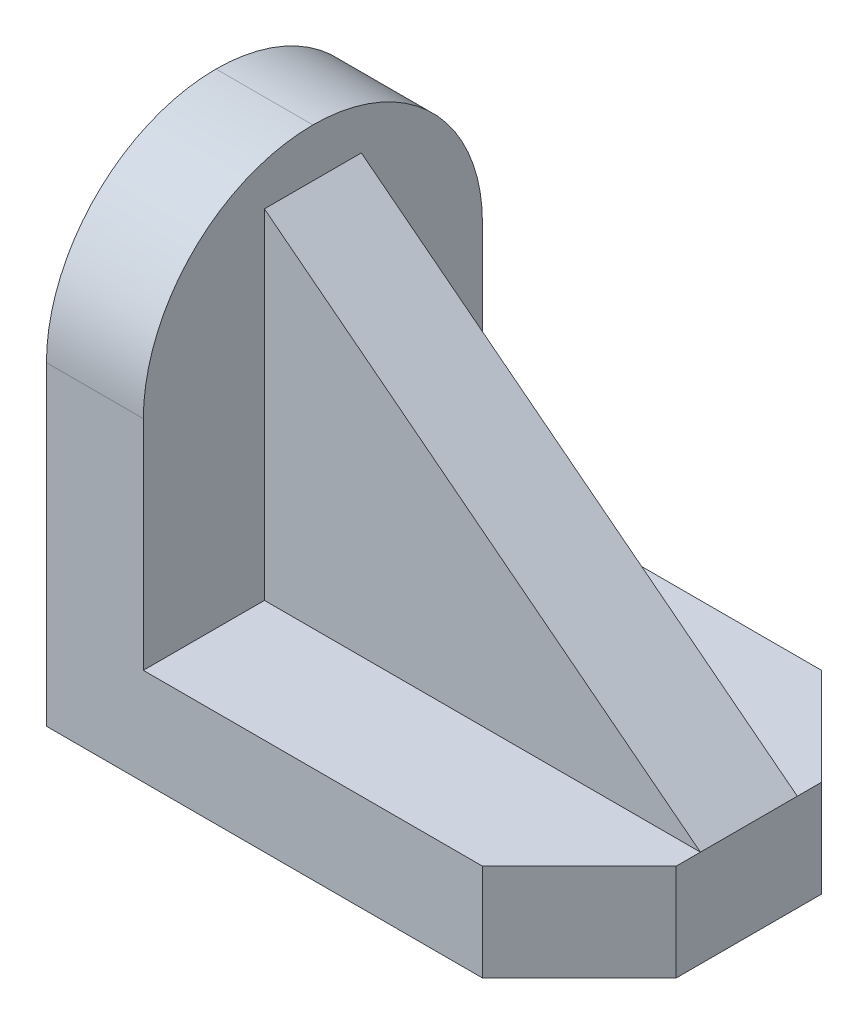
ISO-10303-21;
HEADER;
FILE_DESCRIPTION(('STEP AP214'),'2;1');
FILE_NAME('part.step','',(''),(''),'','','');
FILE_SCHEMA(('AUTOMOTIVE_DESIGN { 1 0 10303 214 1 1 1 1 }'));
ENDSEC;
DATA;
#1=APPLICATION_CONTEXT('core data for automotive mechanical design processes');
#2=APPLICATION_PROTOCOL_DEFINITION('international standard','automotive_design',2000,#1);
#3=PRODUCT_CONTEXT('',#1,'mechanical');
#4=PRODUCT('Part','Part','',(#3));
#5=PRODUCT_RELATED_PRODUCT_CATEGORY('part','',(#4));
#6=PRODUCT_DEFINITION_FORMATION('','',#4);
#7=PRODUCT_DEFINITION_CONTEXT('part definition',#1,'design');
#8=PRODUCT_DEFINITION('design','',#6,#7);
#9=PRODUCT_DEFINITION_SHAPE('','',#8);
#10=(LENGTH_UNIT() NAMED_UNIT(*) SI_UNIT(.MILLI.,.METRE.));
#11=(NAMED_UNIT(*) PLANE_ANGLE_UNIT() SI_UNIT($,.RADIAN.));
#12=(NAMED_UNIT(*) SI_UNIT($,.STERADIAN.) SOLID_ANGLE_UNIT());
#13=UNCERTAINTY_MEASURE_WITH_UNIT(LENGTH_MEASURE(1.E-05),#10,'distance_accuracy_value','');
#14=(GEOMETRIC_REPRESENTATION_CONTEXT(3) GLOBAL_UNCERTAINTY_ASSIGNED_CONTEXT((#13)) GLOBAL_UNIT_ASSIGNED_CONTEXT((#10,
#11,#12)) REPRESENTATION_CONTEXT('',''));
#15=CARTESIAN_POINT('',(0.,0.,0.));
#16=DIRECTION('',(0.,0.,1.));
#17=DIRECTION('',(1.,0.,0.));
#18=AXIS2_PLACEMENT_3D('',#15,#16,#17);
#19=CARTESIAN_POINT('',(0.,12.,0.));
#20=DIRECTION('',(0.,1.,0.));
#21=DIRECTION('',(0.,0.,1.));
#22=AXIS2_PLACEMENT_3D('',#19,#20,#21);
#23=PLANE('',#22);
#24=DIRECTION('',(0.,0.,-1.));
#25=VECTOR('',#24,1.);
#26=CARTESIAN_POINT('',(-21.,12.,-21.));
#27=LINE('',#26,#25);
#28=CARTESIAN_POINT('',(-21.,12.,-6.));
#29=VERTEX_POINT('',#28);
#30=CARTESIAN_POINT('',(-21.,12.,-21.));
#31=VERTEX_POINT('',#30);
#32=EDGE_CURVE('E166',#29,#31,#27,.T.);
#33=ORIENTED_EDGE('',*,*,#32,.F.);
#34=DIRECTION('',(1.,0.,0.));
#35=VECTOR('',#34,1.);
#36=CARTESIAN_POINT('',(33.,12.,-6.));
#37=LINE('',#36,#35);
#38=CARTESIAN_POINT('',(33.,12.,-6.));
#39=VERTEX_POINT('',#38);
#40=EDGE_CURVE('E58',#29,#39,#37,.T.);
#41=ORIENTED_EDGE('',*,*,#40,.T.);
#42=DIRECTION('',(0.,0.,-1.));
#43=VECTOR('',#42,1.);
#44=CARTESIAN_POINT('',(33.,12.,-21.));
#45=LINE('',#44,#43);
#46=CARTESIAN_POINT('',(33.,12.,-8.99999999999996));
#47=VERTEX_POINT('',#46);
#48=EDGE_CURVE('E178',#39,#47,#45,.T.);
#49=ORIENTED_EDGE('',*,*,#48,.T.);
#50=DIRECTION('',(0.707106781186548,0.,0.707106781186548));
#51=VECTOR('',#50,1.);
#52=CARTESIAN_POINT('',(21.,12.,-21.));
#53=LINE('',#52,#51);
#54=CARTESIAN_POINT('',(21.,12.,-21.));
#55=VERTEX_POINT('',#54);
#56=EDGE_CURVE('E227',#47,#55,#53,.F.);
#57=ORIENTED_EDGE('',*,*,#56,.T.);
#58=DIRECTION('',(-1.,0.,0.));
#59=VECTOR('',#58,1.);
#60=CARTESIAN_POINT('',(-33.,12.,-21.));
#61=LINE('',#60,#59);
#62=EDGE_CURVE('E177',#55,#31,#61,.T.);
#63=ORIENTED_EDGE('',*,*,#62,.T.);
#64=EDGE_LOOP('',(#33,#41,#49,#57,#63));
#65=FACE_BOUND('',#64,.T.);
#66=ADVANCED_FACE('F41',(#65),#23,.T.);
#67=CARTESIAN_POINT('',(33.,12.,-21.));
#68=DIRECTION('',(-1.,0.,0.));
#69=DIRECTION('',(0.,0.,1.));
#70=AXIS2_PLACEMENT_3D('',#67,#68,#69);
#71=PLANE('',#70);
#72=DIRECTION('',(0.,0.,-1.));
#73=VECTOR('',#72,1.);
#74=CARTESIAN_POINT('',(33.,0.,-21.));
#75=LINE('',#74,#73);
#76=CARTESIAN_POINT('',(33.,0.,8.99999999999995));
#77=VERTEX_POINT('',#76);
#78=CARTESIAN_POINT('',(33.,0.,-8.99999999999996));
#79=VERTEX_POINT('',#78);
#80=EDGE_CURVE('E173',#77,#79,#75,.T.);
#81=ORIENTED_EDGE('',*,*,#80,.T.);
#82=DIRECTION('',(0.,1.,0.));
#83=VECTOR('',#82,1.);
#84=CARTESIAN_POINT('',(33.,12.,-8.99999999999996));
#85=LINE('',#84,#83);
#86=EDGE_CURVE('E220',#79,#47,#85,.T.);
#87=ORIENTED_EDGE('',*,*,#86,.T.);
#88=ORIENTED_EDGE('',*,*,#48,.F.);
#89=DIRECTION('',(0.,0.,-1.));
#90=VECTOR('',#89,1.);
#91=CARTESIAN_POINT('',(33.,12.,6.));
#92=LINE('',#91,#90);
#93=CARTESIAN_POINT('',(33.,12.,5.99999999999999));
#94=VERTEX_POINT('',#93);
#95=EDGE_CURVE('E65',#94,#39,#92,.T.);
#96=ORIENTED_EDGE('',*,*,#95,.F.);
#97=CARTESIAN_POINT('',(33.,12.,8.99999999999995));
#98=VERTEX_POINT('',#97);
#99=EDGE_CURVE('E174',#98,#94,#45,.T.);
#100=ORIENTED_EDGE('',*,*,#99,.F.);
#101=DIRECTION('',(0.,-1.,0.));
#102=VECTOR('',#101,1.);
#103=CARTESIAN_POINT('',(33.,12.,8.99999999999996));
#104=LINE('',#103,#102);
#105=EDGE_CURVE('E216',#98,#77,#104,.T.);
#106=ORIENTED_EDGE('',*,*,#105,.T.);
#107=EDGE_LOOP('',(#81,#87,#88,#96,#100,#106));
#108=FACE_BOUND('',#107,.T.);
#109=ADVANCED_FACE('F292',(#108),#71,.F.);
#110=CARTESIAN_POINT('',(-33.,12.,-21.));
#111=DIRECTION('',(0.,0.,1.));
#112=DIRECTION('',(1.,0.,0.));
#113=AXIS2_PLACEMENT_3D('',#110,#111,#112);
#114=PLANE('',#113);
#115=DIRECTION('',(0.,-1.,0.));
#116=VECTOR('',#115,1.);
#117=CARTESIAN_POINT('',(-33.,12.,-21.));
#118=LINE('',#117,#116);
#119=CARTESIAN_POINT('',(-33.,39.,-21.));
#120=VERTEX_POINT('',#119);
#121=CARTESIAN_POINT('',(-33.,0.,-21.));
#122=VERTEX_POINT('',#121);
#123=EDGE_CURVE('E203',#120,#122,#118,.T.);
#124=ORIENTED_EDGE('',*,*,#123,.F.);
#125=DIRECTION('',(-1.,0.,0.));
#126=VECTOR('',#125,1.);
#127=CARTESIAN_POINT('',(-21.,39.,-21.));
#128=LINE('',#127,#126);
#129=CARTESIAN_POINT('',(-21.,39.,-21.));
#130=VERTEX_POINT('',#129);
#131=EDGE_CURVE('E11',#120,#130,#128,.F.);
#132=ORIENTED_EDGE('',*,*,#131,.T.);
#133=DIRECTION('',(0.,-1.,0.));
#134=VECTOR('',#133,1.);
#135=CARTESIAN_POINT('',(-21.,60.,-21.));
#136=LINE('',#135,#134);
#137=EDGE_CURVE('E165',#130,#31,#136,.T.);
#138=ORIENTED_EDGE('',*,*,#137,.T.);
#139=ORIENTED_EDGE('',*,*,#62,.F.);
#140=DIRECTION('',(0.,-1.,0.));
#141=VECTOR('',#140,1.);
#142=CARTESIAN_POINT('',(21.,12.,-21.));
#143=LINE('',#142,#141);
#144=CARTESIAN_POINT('',(21.,0.,-21.));
#145=VERTEX_POINT('',#144);
#146=EDGE_CURVE('E206',#55,#145,#143,.T.);
#147=ORIENTED_EDGE('',*,*,#146,.T.);
#148=DIRECTION('',(-1.,0.,0.));
#149=VECTOR('',#148,1.);
#150=CARTESIAN_POINT('',(-33.,0.,-21.));
#151=LINE('',#150,#149);
#152=EDGE_CURVE('E189',#145,#122,#151,.T.);
#153=ORIENTED_EDGE('',*,*,#152,.T.);
#154=EDGE_LOOP('',(#124,#132,#138,#139,#147,#153));
#155=FACE_BOUND('',#154,.T.);
#156=ADVANCED_FACE('F267',(#155),#114,.F.);
#157=CARTESIAN_POINT('',(-33.,12.,-21.));
#158=DIRECTION('',(1.,0.,0.));
#159=DIRECTION('',(0.,0.,-1.));
#160=AXIS2_PLACEMENT_3D('',#157,#158,#159);
#161=PLANE('',#160);
#162=DIRECTION('',(0.,-1.,0.));
#163=VECTOR('',#162,1.);
#164=CARTESIAN_POINT('',(-33.,12.,21.));
#165=LINE('',#164,#163);
#166=CARTESIAN_POINT('',(-33.,39.,21.));
#167=VERTEX_POINT('',#166);
#168=CARTESIAN_POINT('',(-33.,0.,21.));
#169=VERTEX_POINT('',#168);
#170=EDGE_CURVE('E185',#167,#169,#165,.T.);
#171=ORIENTED_EDGE('',*,*,#170,.F.);
#172=CARTESIAN_POINT('',(-33.,39.,0.));
#173=DIRECTION('',(1.,0.,0.));
#174=DIRECTION('',(0.,0.,-1.));
#175=AXIS2_PLACEMENT_3D('',#172,#173,#174);
#176=CIRCLE('',#175,21.);
#177=CARTESIAN_POINT('',(-33.,60.,0.));
#178=VERTEX_POINT('',#177);
#179=EDGE_CURVE('E51',#167,#178,#176,.F.);
#180=ORIENTED_EDGE('',*,*,#179,.T.);
#181=CARTESIAN_POINT('',(-33.,39.,0.));
#182=DIRECTION('',(1.,0.,0.));
#183=DIRECTION('',(0.,0.,-1.));
#184=AXIS2_PLACEMENT_3D('',#181,#182,#183);
#185=CIRCLE('',#184,21.);
#186=EDGE_CURVE('E244',#178,#120,#185,.F.);
#187=ORIENTED_EDGE('',*,*,#186,.T.);
#188=ORIENTED_EDGE('',*,*,#123,.T.);
#189=DIRECTION('',(0.,0.,1.));
#190=VECTOR('',#189,1.);
#191=CARTESIAN_POINT('',(-33.,0.,-21.));
#192=LINE('',#191,#190);
#193=EDGE_CURVE('E193',#122,#169,#192,.T.);
#194=ORIENTED_EDGE('',*,*,#193,.T.);
#195=EDGE_LOOP('',(#171,#180,#187,#188,#194));
#196=FACE_BOUND('',#195,.T.);
#197=ADVANCED_FACE('F251',(#196),#161,.F.);
#198=CARTESIAN_POINT('',(-33.,12.,21.));
#199=DIRECTION('',(0.,0.,-1.));
#200=DIRECTION('',(-1.,0.,0.));
#201=AXIS2_PLACEMENT_3D('',#198,#199,#200);
#202=PLANE('',#201);
#203=DIRECTION('',(0.,-1.,0.));
#204=VECTOR('',#203,1.);
#205=CARTESIAN_POINT('',(-21.,60.,21.));
#206=LINE('',#205,#204);
#207=CARTESIAN_POINT('',(-21.,39.,21.));
#208=VERTEX_POINT('',#207);
#209=CARTESIAN_POINT('',(-21.,12.,21.));
#210=VERTEX_POINT('',#209);
#211=EDGE_CURVE('E170',#208,#210,#206,.T.);
#212=ORIENTED_EDGE('',*,*,#211,.F.);
#213=DIRECTION('',(1.,0.,0.));
#214=VECTOR('',#213,1.);
#215=CARTESIAN_POINT('',(-33.,39.,21.));
#216=LINE('',#215,#214);
#217=EDGE_CURVE('E240',#208,#167,#216,.F.);
#218=ORIENTED_EDGE('',*,*,#217,.T.);
#219=ORIENTED_EDGE('',*,*,#170,.T.);
#220=DIRECTION('',(1.,0.,0.));
#221=VECTOR('',#220,1.);
#222=CARTESIAN_POINT('',(-33.,0.,21.));
#223=LINE('',#222,#221);
#224=CARTESIAN_POINT('',(21.,0.,21.));
#225=VERTEX_POINT('',#224);
#226=EDGE_CURVE('E197',#169,#225,#223,.T.);
#227=ORIENTED_EDGE('',*,*,#226,.T.);
#228=DIRECTION('',(0.,1.,0.));
#229=VECTOR('',#228,1.);
#230=CARTESIAN_POINT('',(21.,12.,21.));
#231=LINE('',#230,#229);
#232=CARTESIAN_POINT('',(21.,12.,21.));
#233=VERTEX_POINT('',#232);
#234=EDGE_CURVE('E230',#225,#233,#231,.T.);
#235=ORIENTED_EDGE('',*,*,#234,.T.);
#236=DIRECTION('',(1.,0.,0.));
#237=VECTOR('',#236,1.);
#238=CARTESIAN_POINT('',(-33.,12.,21.));
#239=LINE('',#238,#237);
#240=EDGE_CURVE('E182',#210,#233,#239,.T.);
#241=ORIENTED_EDGE('',*,*,#240,.F.);
#242=EDGE_LOOP('',(#212,#218,#219,#227,#235,#241));
#243=FACE_BOUND('',#242,.T.);
#244=ADVANCED_FACE('F282',(#243),#202,.F.);
#245=DIRECTION('',(1.,0.,0.));
#246=VECTOR('',#245,1.);
#247=CARTESIAN_POINT('',(33.,12.,6.));
#248=LINE('',#247,#246);
#249=CARTESIAN_POINT('',(-21.,12.,5.99999999999999));
#250=VERTEX_POINT('',#249);
#251=EDGE_CURVE('E418',#250,#94,#248,.T.);
#252=ORIENTED_EDGE('',*,*,#251,.F.);
#253=EDGE_CURVE('E162',#210,#250,#27,.T.);
#254=ORIENTED_EDGE('',*,*,#253,.F.);
#255=ORIENTED_EDGE('',*,*,#240,.T.);
#256=DIRECTION('',(-0.707106781186548,0.,0.707106781186548));
#257=VECTOR('',#256,1.);
#258=CARTESIAN_POINT('',(21.,12.,21.));
#259=LINE('',#258,#257);
#260=EDGE_CURVE('E224',#233,#98,#259,.F.);
#261=ORIENTED_EDGE('',*,*,#260,.T.);
#262=ORIENTED_EDGE('',*,*,#99,.T.);
#263=EDGE_LOOP('',(#252,#254,#255,#261,#262));
#264=FACE_BOUND('',#263,.T.);
#265=ADVANCED_FACE('F289',(#264),#23,.T.);
#266=CARTESIAN_POINT('',(0.,0.,0.));
#267=DIRECTION('',(0.,1.,0.));
#268=DIRECTION('',(0.,0.,1.));
#269=AXIS2_PLACEMENT_3D('',#266,#267,#268);
#270=PLANE('',#269);
#271=ORIENTED_EDGE('',*,*,#152,.F.);
#272=DIRECTION('',(-0.707106781186548,0.,-0.707106781186548));
#273=VECTOR('',#272,1.);
#274=CARTESIAN_POINT('',(21.,0.,-21.));
#275=LINE('',#274,#273);
#276=EDGE_CURVE('E213',#145,#79,#275,.F.);
#277=ORIENTED_EDGE('',*,*,#276,.T.);
#278=ORIENTED_EDGE('',*,*,#80,.F.);
#279=DIRECTION('',(0.707106781186548,0.,-0.707106781186548));
#280=VECTOR('',#279,1.);
#281=CARTESIAN_POINT('',(33.,0.,8.99999999999996));
#282=LINE('',#281,#280);
#283=EDGE_CURVE('E210',#77,#225,#282,.F.);
#284=ORIENTED_EDGE('',*,*,#283,.T.);
#285=ORIENTED_EDGE('',*,*,#226,.F.);
#286=ORIENTED_EDGE('',*,*,#193,.F.);
#287=EDGE_LOOP('',(#271,#277,#278,#284,#285,#286));
#288=FACE_BOUND('',#287,.T.);
#289=ADVANCED_FACE('F276',(#288),#270,.F.);
#290=CARTESIAN_POINT('',(21.,12.,-21.));
#291=DIRECTION('',(-0.707106781186547,0.,0.707106781186547));
#292=DIRECTION('',(0.,-1.,0.));
#293=AXIS2_PLACEMENT_3D('',#290,#291,#292);
#294=PLANE('',#293);
#295=ORIENTED_EDGE('',*,*,#56,.F.);
#296=ORIENTED_EDGE('',*,*,#86,.F.);
#297=ORIENTED_EDGE('',*,*,#276,.F.);
#298=ORIENTED_EDGE('',*,*,#146,.F.);
#299=EDGE_LOOP('',(#295,#296,#297,#298));
#300=FACE_BOUND('',#299,.T.);
#301=ADVANCED_FACE('F272',(#300),#294,.F.);
#302=CARTESIAN_POINT('',(33.,12.,8.99999999999996));
#303=DIRECTION('',(-0.707106781186547,0.,-0.707106781186547));
#304=DIRECTION('',(0.,-1.,0.));
#305=AXIS2_PLACEMENT_3D('',#302,#303,#304);
#306=PLANE('',#305);
#307=ORIENTED_EDGE('',*,*,#260,.F.);
#308=ORIENTED_EDGE('',*,*,#234,.F.);
#309=ORIENTED_EDGE('',*,*,#283,.F.);
#310=ORIENTED_EDGE('',*,*,#105,.F.);
#311=EDGE_LOOP('',(#307,#308,#309,#310));
#312=FACE_BOUND('',#311,.T.);
#313=ADVANCED_FACE('F286',(#312),#306,.F.);
#314=CARTESIAN_POINT('',(-21.,60.,-21.));
#315=DIRECTION('',(-1.,0.,0.));
#316=DIRECTION('',(0.,0.,1.));
#317=AXIS2_PLACEMENT_3D('',#314,#315,#316);
#318=PLANE('',#317);
#319=ORIENTED_EDGE('',*,*,#253,.T.);
#320=DIRECTION('',(0.,-1.,0.));
#321=VECTOR('',#320,1.);
#322=CARTESIAN_POINT('',(-21.,12.,6.));
#323=LINE('',#322,#321);
#324=CARTESIAN_POINT('',(-21.,54.,6.));
#325=VERTEX_POINT('',#324);
#326=EDGE_CURVE('E139',#325,#250,#323,.T.);
#327=ORIENTED_EDGE('',*,*,#326,.F.);
#328=DIRECTION('',(0.,0.,-1.));
#329=VECTOR('',#328,1.);
#330=CARTESIAN_POINT('',(-21.,54.,6.));
#331=LINE('',#330,#329);
#332=CARTESIAN_POINT('',(-21.,54.,-6.));
#333=VERTEX_POINT('',#332);
#334=EDGE_CURVE('E132',#325,#333,#331,.T.);
#335=ORIENTED_EDGE('',*,*,#334,.T.);
#336=DIRECTION('',(0.,-1.,0.));
#337=VECTOR('',#336,1.);
#338=CARTESIAN_POINT('',(-21.,12.,-6.));
#339=LINE('',#338,#337);
#340=EDGE_CURVE('E137',#333,#29,#339,.T.);
#341=ORIENTED_EDGE('',*,*,#340,.T.);
#342=ORIENTED_EDGE('',*,*,#32,.T.);
#343=ORIENTED_EDGE('',*,*,#137,.F.);
#344=CARTESIAN_POINT('',(-21.,39.,0.));
#345=DIRECTION('',(-1.,0.,0.));
#346=DIRECTION('',(0.,0.,1.));
#347=AXIS2_PLACEMENT_3D('',#344,#345,#346);
#348=CIRCLE('',#347,21.);
#349=CARTESIAN_POINT('',(-21.,60.,0.));
#350=VERTEX_POINT('',#349);
#351=EDGE_CURVE('E234',#130,#350,#348,.F.);
#352=ORIENTED_EDGE('',*,*,#351,.T.);
#353=CARTESIAN_POINT('',(-21.,39.,0.));
#354=DIRECTION('',(-1.,0.,0.));
#355=DIRECTION('',(0.,0.,1.));
#356=AXIS2_PLACEMENT_3D('',#353,#354,#355);
#357=CIRCLE('',#356,21.);
#358=EDGE_CURVE('E237',#350,#208,#357,.F.);
#359=ORIENTED_EDGE('',*,*,#358,.T.);
#360=ORIENTED_EDGE('',*,*,#211,.T.);
#361=EDGE_LOOP('',(#319,#327,#335,#341,#342,#343,#352,#359,#360));
#362=FACE_BOUND('',#361,.T.);
#363=ADVANCED_FACE('F135',(#362),#318,.F.);
#364=CARTESIAN_POINT('',(0.,39.,0.));
#365=DIRECTION('',(1.,0.,0.));
#366=DIRECTION('',(0.,0.,-1.));
#367=AXIS2_PLACEMENT_3D('',#364,#365,#366);
#368=CYLINDRICAL_SURFACE('',#367,21.);
#369=ORIENTED_EDGE('',*,*,#131,.F.);
#370=ORIENTED_EDGE('',*,*,#186,.F.);
#371=DIRECTION('',(-1.,0.,0.));
#372=VECTOR('',#371,1.);
#373=CARTESIAN_POINT('',(-33.,60.,0.));
#374=LINE('',#373,#372);
#375=EDGE_CURVE('E45',#350,#178,#374,.T.);
#376=ORIENTED_EDGE('',*,*,#375,.F.);
#377=ORIENTED_EDGE('',*,*,#351,.F.);
#378=EDGE_LOOP('',(#369,#370,#376,#377));
#379=FACE_BOUND('',#378,.T.);
#380=ADVANCED_FACE('F43',(#379),#368,.T.);
#381=CARTESIAN_POINT('',(0.,39.,0.));
#382=DIRECTION('',(-1.,0.,0.));
#383=DIRECTION('',(0.,0.,1.));
#384=AXIS2_PLACEMENT_3D('',#381,#382,#383);
#385=CYLINDRICAL_SURFACE('',#384,21.);
#386=ORIENTED_EDGE('',*,*,#179,.F.);
#387=ORIENTED_EDGE('',*,*,#217,.F.);
#388=ORIENTED_EDGE('',*,*,#358,.F.);
#389=ORIENTED_EDGE('',*,*,#375,.T.);
#390=EDGE_LOOP('',(#386,#387,#388,#389));
#391=FACE_BOUND('',#390,.T.);
#392=ADVANCED_FACE('F261',(#391),#385,.T.);
#393=CARTESIAN_POINT('',(-21.,54.,6.));
#394=DIRECTION('',(-0.61394061351492,-0.789352217376326,0.));
#395=DIRECTION('',(0.789352217376326,-0.61394061351492,0.));
#396=AXIS2_PLACEMENT_3D('',#393,#394,#395);
#397=PLANE('',#396);
#398=DIRECTION('',(-0.789352217376326,0.61394061351492,0.));
#399=VECTOR('',#398,1.);
#400=CARTESIAN_POINT('',(-21.,54.,-6.));
#401=LINE('',#400,#399);
#402=EDGE_CURVE('E147',#39,#333,#401,.T.);
#403=ORIENTED_EDGE('',*,*,#402,.T.);
#404=ORIENTED_EDGE('',*,*,#334,.F.);
#405=DIRECTION('',(-0.789352217376326,0.61394061351492,0.));
#406=VECTOR('',#405,1.);
#407=CARTESIAN_POINT('',(-21.,54.,6.));
#408=LINE('',#407,#406);
#409=EDGE_CURVE('E144',#94,#325,#408,.T.);
#410=ORIENTED_EDGE('',*,*,#409,.F.);
#411=ORIENTED_EDGE('',*,*,#95,.T.);
#412=EDGE_LOOP('',(#403,#404,#410,#411));
#413=FACE_BOUND('',#412,.T.);
#414=ADVANCED_FACE('F148',(#413),#397,.F.);
#415=CARTESIAN_POINT('',(0.,0.,6.));
#416=DIRECTION('',(0.,0.,1.));
#417=DIRECTION('',(1.,0.,0.));
#418=AXIS2_PLACEMENT_3D('',#415,#416,#417);
#419=PLANE('',#418);
#420=ORIENTED_EDGE('',*,*,#326,.T.);
#421=ORIENTED_EDGE('',*,*,#251,.T.);
#422=ORIENTED_EDGE('',*,*,#409,.T.);
#423=EDGE_LOOP('',(#420,#421,#422));
#424=FACE_BOUND('',#423,.T.);
#425=ADVANCED_FACE('F318',(#424),#419,.T.);
#426=CARTESIAN_POINT('',(0.,0.,-6.));
#427=DIRECTION('',(0.,0.,1.));
#428=DIRECTION('',(1.,0.,0.));
#429=AXIS2_PLACEMENT_3D('',#426,#427,#428);
#430=PLANE('',#429);
#431=ORIENTED_EDGE('',*,*,#340,.F.);
#432=ORIENTED_EDGE('',*,*,#402,.F.);
#433=ORIENTED_EDGE('',*,*,#40,.F.);
#434=EDGE_LOOP('',(#431,#432,#433));
#435=FACE_BOUND('',#434,.T.);
#436=ADVANCED_FACE('F152',(#435),#430,.F.);
#437=CLOSED_SHELL('',(#66,#109,#156,#197,#244,#265,#289,#301,#313,#363,#380,#392,#414,#425,#436));
#438=MANIFOLD_SOLID_BREP('B2',#437);
#439=ADVANCED_BREP_SHAPE_REPRESENTATION('',(#18,#438),#14);
#440=SHAPE_DEFINITION_REPRESENTATION(#9,#439);
ENDSEC;
END-ISO-10303-21;
